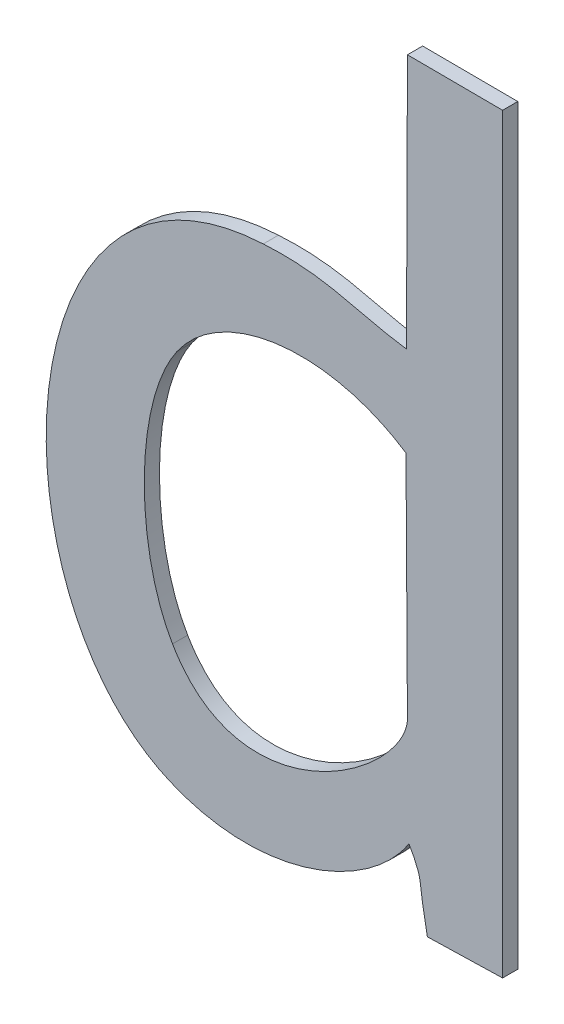
ISO-10303-21;
HEADER;
FILE_DESCRIPTION(('STEP AP214'),'2;1');
FILE_NAME('part.step','',(''),(''),'','','');
FILE_SCHEMA(('AUTOMOTIVE_DESIGN { 1 0 10303 214 1 1 1 1 }'));
ENDSEC;
DATA;
#1=APPLICATION_CONTEXT('core data for automotive mechanical design processes');
#2=APPLICATION_PROTOCOL_DEFINITION('international standard','automotive_design',2000,#1);
#3=PRODUCT_CONTEXT('',#1,'mechanical');
#4=PRODUCT('Part','Part','',(#3));
#5=PRODUCT_RELATED_PRODUCT_CATEGORY('part','',(#4));
#6=PRODUCT_DEFINITION_FORMATION('','',#4);
#7=PRODUCT_DEFINITION_CONTEXT('part definition',#1,'design');
#8=PRODUCT_DEFINITION('design','',#6,#7);
#9=PRODUCT_DEFINITION_SHAPE('','',#8);
#10=(LENGTH_UNIT() NAMED_UNIT(*) SI_UNIT(.MILLI.,.METRE.));
#11=(NAMED_UNIT(*) PLANE_ANGLE_UNIT() SI_UNIT($,.RADIAN.));
#12=(NAMED_UNIT(*) SI_UNIT($,.STERADIAN.) SOLID_ANGLE_UNIT());
#13=UNCERTAINTY_MEASURE_WITH_UNIT(LENGTH_MEASURE(1.E-05),#10,'distance_accuracy_value','');
#14=(GEOMETRIC_REPRESENTATION_CONTEXT(3) GLOBAL_UNCERTAINTY_ASSIGNED_CONTEXT((#13)) GLOBAL_UNIT_ASSIGNED_CONTEXT((#10,
#11,#12)) REPRESENTATION_CONTEXT('',''));
#15=CARTESIAN_POINT('',(0.,0.,0.));
#16=DIRECTION('',(0.,0.,1.));
#17=DIRECTION('',(1.,0.,0.));
#18=AXIS2_PLACEMENT_3D('',#15,#16,#17);
#19=CARTESIAN_POINT('',(-21.9481425563144,-12.193412531205,0.001));
#20=DIRECTION('',(0.874157276122904,0.485642931176173,0.));
#21=DIRECTION('',(-0.485642931176173,0.874157276122904,0.));
#22=AXIS2_PLACEMENT_3D('',#19,#20,#21);
#23=PLANE('',#22);
#24=DIRECTION('',(0.485642931176173,-0.874157276122904,0.));
#25=VECTOR('',#24,1.);
#26=CARTESIAN_POINT('',(-21.9481425563144,-12.193412531205,0.));
#27=LINE('',#26,#25);
#28=CARTESIAN_POINT('',(-1.703489296875,-48.6337883984375,0.));
#29=VERTEX_POINT('',#28);
#30=CARTESIAN_POINT('',(-1.703169375,-48.6343642578125,0.));
#31=VERTEX_POINT('',#30);
#32=EDGE_CURVE('E11',#29,#31,#27,.T.);
#33=ORIENTED_EDGE('',*,*,#32,.T.);
#34=DIRECTION('',(0.,0.,-1.));
#35=VECTOR('',#34,1.);
#36=CARTESIAN_POINT('',(-1.703169375,-48.6343642578125,0.001));
#37=LINE('',#36,#35);
#38=CARTESIAN_POINT('',(-1.703169375,-48.6343642578125,0.001));
#39=VERTEX_POINT('',#38);
#40=EDGE_CURVE('E24',#39,#31,#37,.T.);
#41=ORIENTED_EDGE('',*,*,#40,.F.);
#42=DIRECTION('',(0.485642931176173,-0.874157276122904,0.));
#43=VECTOR('',#42,1.);
#44=CARTESIAN_POINT('',(-21.9481425563144,-12.193412531205,0.001));
#45=LINE('',#44,#43);
#46=CARTESIAN_POINT('',(-1.703489296875,-48.6337883984375,0.001));
#47=VERTEX_POINT('',#46);
#48=EDGE_CURVE('E272',#47,#39,#45,.T.);
#49=ORIENTED_EDGE('',*,*,#48,.F.);
#50=DIRECTION('',(0.,0.,-1.));
#51=VECTOR('',#50,1.);
#52=CARTESIAN_POINT('',(-1.703489296875,-48.6337883984375,0.001));
#53=LINE('',#52,#51);
#54=EDGE_CURVE('E267',#47,#29,#53,.T.);
#55=ORIENTED_EDGE('',*,*,#54,.T.);
#56=EDGE_LOOP('',(#33,#41,#49,#55));
#57=FACE_BOUND('',#56,.T.);
#58=ADVANCED_FACE('F17',(#57),#23,.F.);
#59=CARTESIAN_POINT('',(-1.703169375,-48.6343642578125,0.001));
#60=CARTESIAN_POINT('',(-1.703169375,-48.6343642578125,0.));
#61=CARTESIAN_POINT('',(-1.70252953125,-48.635739921875,0.001));
#62=CARTESIAN_POINT('',(-1.70252953125,-48.635739921875,0.));
#63=CARTESIAN_POINT('',(-1.7029454296875,-48.6351320703125,0.001));
#64=CARTESIAN_POINT('',(-1.7029454296875,-48.6351320703125,0.));
#65=CARTESIAN_POINT('',(-1.70227359375,-48.63849125,0.001));
#66=CARTESIAN_POINT('',(-1.70227359375,-48.63849125,0.));
#67=B_SPLINE_SURFACE_WITH_KNOTS('',3,1,((#59,#60),(#61,#62),(#63,#64),(#65,#66)),.UNSPECIFIED.,
.F.,.F.,.F.,(4,4),(2,2),(0.4,0.5),(0.,1.),.UNSPECIFIED.);
#68=CARTESIAN_POINT('',(-1.703169375,-48.6343642578125,0.));
#69=CARTESIAN_POINT('',(-1.70252953125,-48.635739921875,0.));
#70=CARTESIAN_POINT('',(-1.7029454296875,-48.6351320703125,0.));
#71=CARTESIAN_POINT('',(-1.70227359375,-48.63849125,0.));
#72=B_SPLINE_CURVE_WITH_KNOTS('',3,(#68,#69,#70,#71),.UNSPECIFIED.,.F.,.F.,(4,4),(0.4,0.5),.UNSPECIFIED.);
#73=CARTESIAN_POINT('',(-1.70227359375,-48.63849125,0.));
#74=VERTEX_POINT('',#73);
#75=EDGE_CURVE('E262',#31,#74,#72,.T.);
#76=DIRECTION('',(0.,0.,-1.));
#77=VECTOR('',#76,1.);
#78=CARTESIAN_POINT('',(-1.70227359375,-48.63849125,0.001));
#79=LINE('',#78,#77);
#80=CARTESIAN_POINT('',(-1.70227359375,-48.63849125,0.001));
#81=VERTEX_POINT('',#80);
#82=EDGE_CURVE('E257',#81,#74,#79,.T.);
#83=CARTESIAN_POINT('',(-1.703169375,-48.6343642578125,0.001));
#84=CARTESIAN_POINT('',(-1.70252953125,-48.635739921875,0.001));
#85=CARTESIAN_POINT('',(-1.7029454296875,-48.6351320703125,0.001));
#86=CARTESIAN_POINT('',(-1.70227359375,-48.63849125,0.001));
#87=B_SPLINE_CURVE_WITH_KNOTS('',3,(#83,#84,#85,#86),.UNSPECIFIED.,.F.,.F.,(4,4),(0.4,0.5),.UNSPECIFIED.);
#88=EDGE_CURVE('E253',#39,#81,#87,.T.);
#89=ORIENTED_EDGE('',*,*,#75,.T.);
#90=ORIENTED_EDGE('',*,*,#82,.F.);
#91=ORIENTED_EDGE('',*,*,#88,.F.);
#92=ORIENTED_EDGE('',*,*,#40,.T.);
#93=EDGE_LOOP('',(#89,#90,#91,#92));
#94=FACE_BOUND('',#93,.T.);
#95=ADVANCED_FACE('F276',(#94),#67,.F.);
#96=CARTESIAN_POINT('',(1.253218593127,-48.5622204838874,0.001));
#97=DIRECTION('',(-0.0257978627032479,0.999667179755315,0.));
#98=DIRECTION('',(-0.999667179755315,-0.0257978627032479,0.));
#99=AXIS2_PLACEMENT_3D('',#96,#97,#98);
#100=PLANE('',#99);
#101=DIRECTION('',(0.999667179755314,0.0257978627032479,0.));
#102=VECTOR('',#101,1.);
#103=CARTESIAN_POINT('',(1.253218593127,-48.5622204838874,0.));
#104=LINE('',#103,#102);
#105=CARTESIAN_POINT('',(-1.6973148046875,-48.63836328125,0.));
#106=VERTEX_POINT('',#105);
#107=EDGE_CURVE('E251',#74,#106,#104,.T.);
#108=ORIENTED_EDGE('',*,*,#107,.T.);
#109=DIRECTION('',(0.,0.,-1.));
#110=VECTOR('',#109,1.);
#111=CARTESIAN_POINT('',(-1.6973148046875,-48.63836328125,0.001));
#112=LINE('',#111,#110);
#113=CARTESIAN_POINT('',(-1.6973148046875,-48.63836328125,0.001));
#114=VERTEX_POINT('',#113);
#115=EDGE_CURVE('E248',#114,#106,#112,.T.);
#116=ORIENTED_EDGE('',*,*,#115,.F.);
#117=DIRECTION('',(0.999667179755314,0.0257978627032479,0.));
#118=VECTOR('',#117,1.);
#119=CARTESIAN_POINT('',(1.253218593127,-48.5622204838874,0.001));
#120=LINE('',#119,#118);
#121=EDGE_CURVE('E245',#81,#114,#120,.T.);
#122=ORIENTED_EDGE('',*,*,#121,.F.);
#123=ORIENTED_EDGE('',*,*,#82,.T.);
#124=EDGE_LOOP('',(#108,#116,#122,#123));
#125=FACE_BOUND('',#124,.T.);
#126=ADVANCED_FACE('F283',(#125),#100,.F.);
#127=CARTESIAN_POINT('',(-1.6973148046875,0.,0.001));
#128=DIRECTION('',(-1.,0.,0.));
#129=DIRECTION('',(0.,0.,1.));
#130=AXIS2_PLACEMENT_3D('',#127,#128,#129);
#131=PLANE('',#130);
#132=DIRECTION('',(0.,1.,0.));
#133=VECTOR('',#132,1.);
#134=CARTESIAN_POINT('',(-1.6973148046875,0.,0.));
#135=LINE('',#134,#133);
#136=CARTESIAN_POINT('',(-1.6973148046875,-48.588839375,0.));
#137=VERTEX_POINT('',#136);
#138=EDGE_CURVE('E243',#106,#137,#135,.T.);
#139=ORIENTED_EDGE('',*,*,#138,.T.);
#140=DIRECTION('',(0.,0.,-1.));
#141=VECTOR('',#140,1.);
#142=CARTESIAN_POINT('',(-1.6973148046875,-48.588839375,0.001));
#143=LINE('',#142,#141);
#144=CARTESIAN_POINT('',(-1.6973148046875,-48.588839375,0.001));
#145=VERTEX_POINT('',#144);
#146=EDGE_CURVE('E240',#145,#137,#143,.T.);
#147=ORIENTED_EDGE('',*,*,#146,.F.);
#148=DIRECTION('',(0.,1.,0.));
#149=VECTOR('',#148,1.);
#150=CARTESIAN_POINT('',(-1.6973148046875,0.,0.001));
#151=LINE('',#150,#149);
#152=EDGE_CURVE('E237',#114,#145,#151,.T.);
#153=ORIENTED_EDGE('',*,*,#152,.F.);
#154=ORIENTED_EDGE('',*,*,#115,.T.);
#155=EDGE_LOOP('',(#139,#147,#153,#154));
#156=FACE_BOUND('',#155,.T.);
#157=ADVANCED_FACE('F287',(#156),#131,.F.);
#158=CARTESIAN_POINT('',(-0.247939970097321,-48.5962341445634,0.001));
#159=DIRECTION('',(-0.0051019744118924,-0.999986984843853,0.));
#160=DIRECTION('',(0.999986984843853,-0.0051019744118924,0.));
#161=AXIS2_PLACEMENT_3D('',#158,#159,#160);
#162=PLANE('',#161);
#163=DIRECTION('',(-0.999986984843853,0.0051019744118924,0.));
#164=VECTOR('',#163,1.);
#165=CARTESIAN_POINT('',(-0.247939970097321,-48.5962341445634,0.));
#166=LINE('',#165,#164);
#167=CARTESIAN_POINT('',(-1.7035852734375,-48.5888073828125,0.));
#168=VERTEX_POINT('',#167);
#169=EDGE_CURVE('E235',#137,#168,#166,.T.);
#170=ORIENTED_EDGE('',*,*,#169,.T.);
#171=DIRECTION('',(0.,0.,-1.));
#172=VECTOR('',#171,1.);
#173=CARTESIAN_POINT('',(-1.7035852734375,-48.5888073828125,0.001));
#174=LINE('',#173,#172);
#175=CARTESIAN_POINT('',(-1.7035852734375,-48.5888073828125,0.001));
#176=VERTEX_POINT('',#175);
#177=EDGE_CURVE('E232',#176,#168,#174,.T.);
#178=ORIENTED_EDGE('',*,*,#177,.F.);
#179=DIRECTION('',(-0.999986984843853,0.0051019744118924,0.));
#180=VECTOR('',#179,1.);
#181=CARTESIAN_POINT('',(-0.247939970097321,-48.5962341445634,0.001));
#182=LINE('',#181,#180);
#183=EDGE_CURVE('E229',#145,#176,#182,.T.);
#184=ORIENTED_EDGE('',*,*,#183,.F.);
#185=ORIENTED_EDGE('',*,*,#146,.T.);
#186=EDGE_LOOP('',(#170,#178,#184,#185));
#187=FACE_BOUND('',#186,.T.);
#188=ADVANCED_FACE('F291',(#187),#162,.F.);
#189=CARTESIAN_POINT('',(-1.5188149983625,0.00577496197095341,0.001));
#190=DIRECTION('',(0.999992771406576,-0.0038022538836708,0.));
#191=DIRECTION('',(0.0038022538836708,0.999992771406576,0.));
#192=AXIS2_PLACEMENT_3D('',#189,#190,#191);
#193=PLANE('',#192);
#194=DIRECTION('',(-0.0038022538836708,-0.999992771406576,0.));
#195=VECTOR('',#194,1.);
#196=CARTESIAN_POINT('',(-1.5188149983625,0.00577496197095341,0.));
#197=LINE('',#196,#195);
#198=CARTESIAN_POINT('',(-1.7036492578125,-48.6056352734375,0.));
#199=VERTEX_POINT('',#198);
#200=EDGE_CURVE('E227',#168,#199,#197,.T.);
#201=ORIENTED_EDGE('',*,*,#200,.T.);
#202=DIRECTION('',(0.,0.,-1.));
#203=VECTOR('',#202,1.);
#204=CARTESIAN_POINT('',(-1.7036492578125,-48.6056352734375,0.001));
#205=LINE('',#204,#203);
#206=CARTESIAN_POINT('',(-1.7036492578125,-48.6056352734375,0.001));
#207=VERTEX_POINT('',#206);
#208=EDGE_CURVE('E224',#207,#199,#205,.T.);
#209=ORIENTED_EDGE('',*,*,#208,.F.);
#210=DIRECTION('',(-0.0038022538836708,-0.999992771406576,0.));
#211=VECTOR('',#210,1.);
#212=CARTESIAN_POINT('',(-1.5188149983625,0.00577496197095341,0.001));
#213=LINE('',#212,#211);
#214=EDGE_CURVE('E218',#176,#207,#213,.T.);
#215=ORIENTED_EDGE('',*,*,#214,.F.);
#216=ORIENTED_EDGE('',*,*,#177,.T.);
#217=EDGE_LOOP('',(#201,#209,#215,#216));
#218=FACE_BOUND('',#217,.T.);
#219=ADVANCED_FACE('F294',(#218),#193,.F.);
#220=CARTESIAN_POINT('',(-1.7036492578125,-48.6056352734375,0.001));
#221=CARTESIAN_POINT('',(-1.7036492578125,-48.6056352734375,0.));
#222=CARTESIAN_POINT('',(-1.7069764453125,-48.6051873828125,0.001));
#223=CARTESIAN_POINT('',(-1.7069764453125,-48.6051873828125,0.));
#224=CARTESIAN_POINT('',(-1.7088,-48.6040996484375,0.001));
#225=CARTESIAN_POINT('',(-1.7088,-48.6040996484375,0.));
#226=CARTESIAN_POINT('',(-1.713086953125,-48.6043555859375,0.001));
#227=CARTESIAN_POINT('',(-1.713086953125,-48.6043555859375,0.));
#228=B_SPLINE_SURFACE_WITH_KNOTS('',3,1,((#220,#221),(#222,#223),(#224,#225),(#226,#227)),
.UNSPECIFIED.,.F.,.F.,.F.,(4,4),(2,2),(0.,0.1),(0.,1.),.UNSPECIFIED.);
#229=CARTESIAN_POINT('',(-1.7036492578125,-48.6056352734375,0.));
#230=CARTESIAN_POINT('',(-1.7069764453125,-48.6051873828125,0.));
#231=CARTESIAN_POINT('',(-1.7088,-48.6040996484375,0.));
#232=CARTESIAN_POINT('',(-1.713086953125,-48.6043555859375,0.));
#233=B_SPLINE_CURVE_WITH_KNOTS('',3,(#229,#230,#231,#232),.UNSPECIFIED.,.F.,.F.,(4,4),(0.,0.1),.UNSPECIFIED.);
#234=CARTESIAN_POINT('',(-1.713086953125,-48.6043555859375,0.));
#235=VERTEX_POINT('',#234);
#236=EDGE_CURVE('E213',#199,#235,#233,.T.);
#237=DIRECTION('',(0.,0.,-1.));
#238=VECTOR('',#237,1.);
#239=CARTESIAN_POINT('',(-1.713086953125,-48.6043555859375,0.001));
#240=LINE('',#239,#238);
#241=CARTESIAN_POINT('',(-1.713086953125,-48.6043555859375,0.001));
#242=VERTEX_POINT('',#241);
#243=EDGE_CURVE('E208',#242,#235,#240,.T.);
#244=CARTESIAN_POINT('',(-1.7036492578125,-48.6056352734375,0.001));
#245=CARTESIAN_POINT('',(-1.7069764453125,-48.6051873828125,0.001));
#246=CARTESIAN_POINT('',(-1.7088,-48.6040996484375,0.001));
#247=CARTESIAN_POINT('',(-1.713086953125,-48.6043555859375,0.001));
#248=B_SPLINE_CURVE_WITH_KNOTS('',3,(#244,#245,#246,#247),.UNSPECIFIED.,.F.,.F.,(4,4),(0.,0.1),.UNSPECIFIED.);
#249=EDGE_CURVE('E201',#207,#242,#248,.T.);
#250=ORIENTED_EDGE('',*,*,#236,.T.);
#251=ORIENTED_EDGE('',*,*,#243,.F.);
#252=ORIENTED_EDGE('',*,*,#249,.F.);
#253=ORIENTED_EDGE('',*,*,#208,.T.);
#254=EDGE_LOOP('',(#250,#251,#252,#253));
#255=FACE_BOUND('',#254,.T.);
#256=ADVANCED_FACE('F299',(#255),#228,.F.);
#257=CARTESIAN_POINT('',(-1.713086953125,-48.6043555859375,0.001));
#258=CARTESIAN_POINT('',(-1.713086953125,-48.6043555859375,0.));
#259=CARTESIAN_POINT('',(-1.73029875,-48.6052513671875,0.001));
#260=CARTESIAN_POINT('',(-1.73029875,-48.6052513671875,0.));
#261=CARTESIAN_POINT('',(-1.731514453125,-48.632860625,0.001));
#262=CARTESIAN_POINT('',(-1.731514453125,-48.632860625,0.));
#263=CARTESIAN_POINT('',(-1.719229453125,-48.63810734375,0.001));
#264=CARTESIAN_POINT('',(-1.719229453125,-48.63810734375,0.));
#265=B_SPLINE_SURFACE_WITH_KNOTS('',3,1,((#257,#258),(#259,#260),(#261,#262),(#263,#264)),
.UNSPECIFIED.,.F.,.F.,.F.,(4,4),(2,2),(0.1,0.2),(0.,1.),.UNSPECIFIED.);
#266=CARTESIAN_POINT('',(-1.713086953125,-48.6043555859375,0.));
#267=CARTESIAN_POINT('',(-1.73029875,-48.6052513671875,0.));
#268=CARTESIAN_POINT('',(-1.731514453125,-48.632860625,0.));
#269=CARTESIAN_POINT('',(-1.719229453125,-48.63810734375,0.));
#270=B_SPLINE_CURVE_WITH_KNOTS('',3,(#266,#267,#268,#269),.UNSPECIFIED.,.F.,.F.,(4,4),(0.1,0.2),.UNSPECIFIED.);
#271=CARTESIAN_POINT('',(-1.719229453125,-48.63810734375,0.));
#272=VERTEX_POINT('',#271);
#273=EDGE_CURVE('E196',#235,#272,#270,.T.);
#274=DIRECTION('',(0.,0.,-1.));
#275=VECTOR('',#274,1.);
#276=CARTESIAN_POINT('',(-1.719229453125,-48.63810734375,0.001));
#277=LINE('',#276,#275);
#278=CARTESIAN_POINT('',(-1.719229453125,-48.63810734375,0.001));
#279=VERTEX_POINT('',#278);
#280=EDGE_CURVE('E191',#279,#272,#277,.T.);
#281=CARTESIAN_POINT('',(-1.713086953125,-48.6043555859375,0.001));
#282=CARTESIAN_POINT('',(-1.73029875,-48.6052513671875,0.001));
#283=CARTESIAN_POINT('',(-1.731514453125,-48.632860625,0.001));
#284=CARTESIAN_POINT('',(-1.719229453125,-48.63810734375,0.001));
#285=B_SPLINE_CURVE_WITH_KNOTS('',3,(#281,#282,#283,#284),.UNSPECIFIED.,.F.,.F.,(4,4),(0.1,0.2),.UNSPECIFIED.);
#286=EDGE_CURVE('E184',#242,#279,#285,.T.);
#287=ORIENTED_EDGE('',*,*,#273,.T.);
#288=ORIENTED_EDGE('',*,*,#280,.F.);
#289=ORIENTED_EDGE('',*,*,#286,.F.);
#290=ORIENTED_EDGE('',*,*,#243,.T.);
#291=EDGE_LOOP('',(#287,#288,#289,#290));
#292=FACE_BOUND('',#291,.T.);
#293=ADVANCED_FACE('F306',(#292),#265,.F.);
#294=CARTESIAN_POINT('',(-1.7190694921875,-48.63017328125,0.001));
#295=CARTESIAN_POINT('',(-1.7190694921875,-48.63017328125,0.));
#296=CARTESIAN_POINT('',(-1.721532890625,-48.626014296875,0.001));
#297=CARTESIAN_POINT('',(-1.721532890625,-48.626014296875,0.));
#298=CARTESIAN_POINT('',(-1.721660859375,-48.617504375,0.001));
#299=CARTESIAN_POINT('',(-1.721660859375,-48.617504375,0.));
#300=CARTESIAN_POINT('',(-1.7187815625,-48.613345390625,0.001));
#301=CARTESIAN_POINT('',(-1.7187815625,-48.613345390625,0.));
#302=B_SPLINE_SURFACE_WITH_KNOTS('',3,1,((#294,#295),(#296,#297),(#298,#299),(#300,#301)),
.UNSPECIFIED.,.F.,.F.,.F.,(4,4),(2,2),(0.2,0.4),(0.,1.),.UNSPECIFIED.);
#303=CARTESIAN_POINT('',(-1.7190694921875,-48.63017328125,0.));
#304=CARTESIAN_POINT('',(-1.721532890625,-48.626014296875,0.));
#305=CARTESIAN_POINT('',(-1.721660859375,-48.617504375,0.));
#306=CARTESIAN_POINT('',(-1.7187815625,-48.613345390625,0.));
#307=B_SPLINE_CURVE_WITH_KNOTS('',3,(#303,#304,#305,#306),.UNSPECIFIED.,.F.,.F.,(4,4),(0.2,0.4),.UNSPECIFIED.);
#308=CARTESIAN_POINT('',(-1.7190694921875,-48.63017328125,0.));
#309=VERTEX_POINT('',#308);
#310=CARTESIAN_POINT('',(-1.7187815625,-48.613345390625,0.));
#311=VERTEX_POINT('',#310);
#312=EDGE_CURVE('E179',#309,#311,#307,.T.);
#313=DIRECTION('',(0.,0.,-1.));
#314=VECTOR('',#313,1.);
#315=CARTESIAN_POINT('',(-1.7187815625,-48.613345390625,0.001));
#316=LINE('',#315,#314);
#317=CARTESIAN_POINT('',(-1.7187815625,-48.613345390625,0.001));
#318=VERTEX_POINT('',#317);
#319=EDGE_CURVE('E174',#318,#311,#316,.T.);
#320=CARTESIAN_POINT('',(-1.7190694921875,-48.63017328125,0.001));
#321=CARTESIAN_POINT('',(-1.721532890625,-48.626014296875,0.001));
#322=CARTESIAN_POINT('',(-1.721660859375,-48.617504375,0.001));
#323=CARTESIAN_POINT('',(-1.7187815625,-48.613345390625,0.001));
#324=B_SPLINE_CURVE_WITH_KNOTS('',3,(#320,#321,#322,#323),.UNSPECIFIED.,.F.,.F.,(4,4),(0.2,0.4),.UNSPECIFIED.);
#325=CARTESIAN_POINT('',(-1.7190694921875,-48.63017328125,0.001));
#326=VERTEX_POINT('',#325);
#327=EDGE_CURVE('E170',#326,#318,#324,.T.);
#328=DIRECTION('',(0.,0.,-1.));
#329=VECTOR('',#328,1.);
#330=CARTESIAN_POINT('',(-1.7190694921875,-48.63017328125,0.001));
#331=LINE('',#330,#329);
#332=EDGE_CURVE('E130',#326,#309,#331,.T.);
#333=ORIENTED_EDGE('',*,*,#312,.T.);
#334=ORIENTED_EDGE('',*,*,#319,.F.);
#335=ORIENTED_EDGE('',*,*,#327,.F.);
#336=ORIENTED_EDGE('',*,*,#332,.T.);
#337=EDGE_LOOP('',(#333,#334,#335,#336));
#338=FACE_BOUND('',#337,.T.);
#339=ADVANCED_FACE('F351',(#338),#302,.F.);
#340=CARTESIAN_POINT('',(-1.7187815625,-48.613345390625,0.001));
#341=CARTESIAN_POINT('',(-1.7187815625,-48.613345390625,0.));
#342=CARTESIAN_POINT('',(-1.715774296875,-48.6090264453125,0.001));
#343=CARTESIAN_POINT('',(-1.715774296875,-48.6090264453125,0.));
#344=CARTESIAN_POINT('',(-1.7087680078125,-48.608226640625,0.001));
#345=CARTESIAN_POINT('',(-1.7087680078125,-48.608226640625,0.));
#346=CARTESIAN_POINT('',(-1.70368125,-48.6115858203125,0.001));
#347=CARTESIAN_POINT('',(-1.70368125,-48.6115858203125,0.));
#348=B_SPLINE_SURFACE_WITH_KNOTS('',3,1,((#340,#341),(#342,#343),(#344,#345),(#346,#347)),
.UNSPECIFIED.,.F.,.F.,.F.,(4,4),(2,2),(0.4,0.6),(0.,1.),.UNSPECIFIED.);
#349=CARTESIAN_POINT('',(-1.7187815625,-48.613345390625,0.));
#350=CARTESIAN_POINT('',(-1.715774296875,-48.6090264453125,0.));
#351=CARTESIAN_POINT('',(-1.7087680078125,-48.608226640625,0.));
#352=CARTESIAN_POINT('',(-1.70368125,-48.6115858203125,0.));
#353=B_SPLINE_CURVE_WITH_KNOTS('',3,(#349,#350,#351,#352),.UNSPECIFIED.,.F.,.F.,(4,4),(0.4,0.6),.UNSPECIFIED.);
#354=CARTESIAN_POINT('',(-1.70368125,-48.6115858203125,0.));
#355=VERTEX_POINT('',#354);
#356=EDGE_CURVE('E161',#311,#355,#353,.T.);
#357=DIRECTION('',(0.,0.,-1.));
#358=VECTOR('',#357,1.);
#359=CARTESIAN_POINT('',(-1.70368125,-48.6115858203125,0.001));
#360=LINE('',#359,#358);
#361=CARTESIAN_POINT('',(-1.70368125,-48.6115858203125,0.001));
#362=VERTEX_POINT('',#361);
#363=EDGE_CURVE('E156',#362,#355,#360,.T.);
#364=CARTESIAN_POINT('',(-1.7187815625,-48.613345390625,0.001));
#365=CARTESIAN_POINT('',(-1.715774296875,-48.6090264453125,0.001));
#366=CARTESIAN_POINT('',(-1.7087680078125,-48.608226640625,0.001));
#367=CARTESIAN_POINT('',(-1.70368125,-48.6115858203125,0.001));
#368=B_SPLINE_CURVE_WITH_KNOTS('',3,(#364,#365,#366,#367),.UNSPECIFIED.,.F.,.F.,(4,4),(0.4,0.6),.UNSPECIFIED.);
#369=EDGE_CURVE('E125',#318,#362,#368,.T.);
#370=ORIENTED_EDGE('',*,*,#356,.T.);
#371=ORIENTED_EDGE('',*,*,#363,.F.);
#372=ORIENTED_EDGE('',*,*,#369,.F.);
#373=ORIENTED_EDGE('',*,*,#319,.T.);
#374=EDGE_LOOP('',(#370,#371,#372,#373));
#375=FACE_BOUND('',#374,.T.);
#376=ADVANCED_FACE('F361',(#375),#348,.F.);
#377=CARTESIAN_POINT('',(-2.0099769510407,-0.0126679219603688,0.001));
#378=DIRECTION('',(0.999980139706132,0.006302395838498,0.));
#379=DIRECTION('',(-0.006302395838498,0.999980139706132,0.));
#380=AXIS2_PLACEMENT_3D('',#377,#378,#379);
#381=PLANE('',#380);
#382=DIRECTION('',(0.006302395838498,-0.999980139706132,0.));
#383=VECTOR('',#382,1.);
#384=CARTESIAN_POINT('',(-2.0099769510407,-0.0126679219603688,0.));
#385=LINE('',#384,#383);
#386=CARTESIAN_POINT('',(-1.7035852734375,-48.6268141015625,0.));
#387=VERTEX_POINT('',#386);
#388=EDGE_CURVE('E113',#355,#387,#385,.T.);
#389=ORIENTED_EDGE('',*,*,#388,.T.);
#390=DIRECTION('',(0.,0.,-1.));
#391=VECTOR('',#390,1.);
#392=CARTESIAN_POINT('',(-1.7035852734375,-48.6268141015625,0.001));
#393=LINE('',#392,#391);
#394=CARTESIAN_POINT('',(-1.7035852734375,-48.6268141015625,0.001));
#395=VERTEX_POINT('',#394);
#396=EDGE_CURVE('E108',#395,#387,#393,.T.);
#397=ORIENTED_EDGE('',*,*,#396,.F.);
#398=DIRECTION('',(0.006302395838498,-0.999980139706132,0.));
#399=VECTOR('',#398,1.);
#400=CARTESIAN_POINT('',(-2.0099769510407,-0.0126679219603688,0.001));
#401=LINE('',#400,#399);
#402=EDGE_CURVE('E111',#362,#395,#401,.T.);
#403=ORIENTED_EDGE('',*,*,#402,.F.);
#404=ORIENTED_EDGE('',*,*,#363,.T.);
#405=EDGE_LOOP('',(#389,#397,#403,#404));
#406=FACE_BOUND('',#405,.T.);
#407=ADVANCED_FACE('F110',(#406),#381,.F.);
#408=CARTESIAN_POINT('',(-1.7035852734375,-48.6268141015625,0.001));
#409=CARTESIAN_POINT('',(-1.7035852734375,-48.6268141015625,0.));
#410=CARTESIAN_POINT('',(-1.7039371875,-48.6303332421875,0.001));
#411=CARTESIAN_POINT('',(-1.7039371875,-48.6303332421875,0.));
#412=CARTESIAN_POINT('',(-1.7144626171875,-48.638043359375,0.001));
#413=CARTESIAN_POINT('',(-1.7144626171875,-48.638043359375,0.));
#414=CARTESIAN_POINT('',(-1.7190694921875,-48.63017328125,0.001));
#415=CARTESIAN_POINT('',(-1.7190694921875,-48.63017328125,0.));
#416=B_SPLINE_SURFACE_WITH_KNOTS('',3,1,((#408,#409),(#410,#411),(#412,#413),(#414,#415)),
.UNSPECIFIED.,.F.,.F.,.F.,(4,4),(2,2),(0.,0.2),(0.,1.),.UNSPECIFIED.);
#417=CARTESIAN_POINT('',(-1.7035852734375,-48.6268141015625,0.));
#418=CARTESIAN_POINT('',(-1.7039371875,-48.6303332421875,0.));
#419=CARTESIAN_POINT('',(-1.7144626171875,-48.638043359375,0.));
#420=CARTESIAN_POINT('',(-1.7190694921875,-48.63017328125,0.));
#421=B_SPLINE_CURVE_WITH_KNOTS('',3,(#417,#418,#419,#420),.UNSPECIFIED.,.F.,.F.,(4,4),(0.,0.2),.UNSPECIFIED.);
#422=EDGE_CURVE('E127',#387,#309,#421,.T.);
#423=CARTESIAN_POINT('',(-1.7035852734375,-48.6268141015625,0.001));
#424=CARTESIAN_POINT('',(-1.7039371875,-48.6303332421875,0.001));
#425=CARTESIAN_POINT('',(-1.7144626171875,-48.638043359375,0.001));
#426=CARTESIAN_POINT('',(-1.7190694921875,-48.63017328125,0.001));
#427=B_SPLINE_CURVE_WITH_KNOTS('',3,(#423,#424,#425,#426),.UNSPECIFIED.,.F.,.F.,(4,4),(0.,0.2),.UNSPECIFIED.);
#428=EDGE_CURVE('E123',#395,#326,#427,.T.);
#429=ORIENTED_EDGE('',*,*,#422,.T.);
#430=ORIENTED_EDGE('',*,*,#332,.F.);
#431=ORIENTED_EDGE('',*,*,#428,.F.);
#432=ORIENTED_EDGE('',*,*,#396,.T.);
#433=EDGE_LOOP('',(#429,#430,#431,#432));
#434=FACE_BOUND('',#433,.T.);
#435=ADVANCED_FACE('F129',(#434),#416,.F.);
#436=CARTESIAN_POINT('',(-1.719229453125,-48.63810734375,0.001));
#437=CARTESIAN_POINT('',(-1.719229453125,-48.63810734375,0.));
#438=CARTESIAN_POINT('',(-1.7128630078125,-48.6408266796875,0.001));
#439=CARTESIAN_POINT('',(-1.7128630078125,-48.6408266796875,0.));
#440=CARTESIAN_POINT('',(-1.705920703125,-48.6376274609375,0.001));
#441=CARTESIAN_POINT('',(-1.705920703125,-48.6376274609375,0.));
#442=CARTESIAN_POINT('',(-1.703489296875,-48.6337883984375,0.001));
#443=CARTESIAN_POINT('',(-1.703489296875,-48.6337883984375,0.));
#444=B_SPLINE_SURFACE_WITH_KNOTS('',3,1,((#436,#437),(#438,#439),(#440,#441),(#442,#443)),
.UNSPECIFIED.,.F.,.F.,.F.,(4,4),(2,2),(0.2,0.3),(0.,1.),.UNSPECIFIED.);
#445=CARTESIAN_POINT('',(-1.719229453125,-48.63810734375,0.));
#446=CARTESIAN_POINT('',(-1.7128630078125,-48.6408266796875,0.));
#447=CARTESIAN_POINT('',(-1.705920703125,-48.6376274609375,0.));
#448=CARTESIAN_POINT('',(-1.703489296875,-48.6337883984375,0.));
#449=B_SPLINE_CURVE_WITH_KNOTS('',3,(#445,#446,#447,#448),.UNSPECIFIED.,.F.,.F.,(4,4),(0.2,0.3),.UNSPECIFIED.);
#450=EDGE_CURVE('E132',#272,#29,#449,.T.);
#451=CARTESIAN_POINT('',(-1.719229453125,-48.63810734375,0.001));
#452=CARTESIAN_POINT('',(-1.7128630078125,-48.6408266796875,0.001));
#453=CARTESIAN_POINT('',(-1.705920703125,-48.6376274609375,0.001));
#454=CARTESIAN_POINT('',(-1.703489296875,-48.6337883984375,0.001));
#455=B_SPLINE_CURVE_WITH_KNOTS('',3,(#451,#452,#453,#454),.UNSPECIFIED.,.F.,.F.,(4,4),(0.2,0.3),.UNSPECIFIED.);
#456=EDGE_CURVE('E136',#279,#47,#455,.T.);
#457=ORIENTED_EDGE('',*,*,#450,.T.);
#458=ORIENTED_EDGE('',*,*,#54,.F.);
#459=ORIENTED_EDGE('',*,*,#456,.F.);
#460=ORIENTED_EDGE('',*,*,#280,.T.);
#461=EDGE_LOOP('',(#457,#458,#459,#460));
#462=FACE_BOUND('',#461,.T.);
#463=ADVANCED_FACE('F309',(#462),#444,.F.);
#464=CARTESIAN_POINT('',(0.,0.,0.001));
#465=DIRECTION('',(0.,0.,1.));
#466=DIRECTION('',(1.,0.,0.));
#467=AXIS2_PLACEMENT_3D('',#464,#465,#466);
#468=PLANE('',#467);
#469=ORIENTED_EDGE('',*,*,#327,.T.);
#470=ORIENTED_EDGE('',*,*,#369,.T.);
#471=ORIENTED_EDGE('',*,*,#402,.T.);
#472=ORIENTED_EDGE('',*,*,#428,.T.);
#473=EDGE_LOOP('',(#469,#470,#471,#472));
#474=FACE_BOUND('',#473,.T.);
#475=ORIENTED_EDGE('',*,*,#48,.T.);
#476=ORIENTED_EDGE('',*,*,#88,.T.);
#477=ORIENTED_EDGE('',*,*,#121,.T.);
#478=ORIENTED_EDGE('',*,*,#152,.T.);
#479=ORIENTED_EDGE('',*,*,#183,.T.);
#480=ORIENTED_EDGE('',*,*,#214,.T.);
#481=ORIENTED_EDGE('',*,*,#249,.T.);
#482=ORIENTED_EDGE('',*,*,#286,.T.);
#483=ORIENTED_EDGE('',*,*,#456,.T.);
#484=EDGE_LOOP('',(#475,#476,#477,#478,#479,#480,#481,#482,#483));
#485=FACE_BOUND('',#484,.T.);
#486=ADVANCED_FACE('F121',(#474,#485),#468,.T.);
#487=CARTESIAN_POINT('',(0.,0.,0.));
#488=DIRECTION('',(0.,0.,1.));
#489=DIRECTION('',(1.,0.,0.));
#490=AXIS2_PLACEMENT_3D('',#487,#488,#489);
#491=PLANE('',#490);
#492=ORIENTED_EDGE('',*,*,#312,.F.);
#493=ORIENTED_EDGE('',*,*,#422,.F.);
#494=ORIENTED_EDGE('',*,*,#388,.F.);
#495=ORIENTED_EDGE('',*,*,#356,.F.);
#496=EDGE_LOOP('',(#492,#493,#494,#495));
#497=FACE_BOUND('',#496,.T.);
#498=ORIENTED_EDGE('',*,*,#32,.F.);
#499=ORIENTED_EDGE('',*,*,#450,.F.);
#500=ORIENTED_EDGE('',*,*,#273,.F.);
#501=ORIENTED_EDGE('',*,*,#236,.F.);
#502=ORIENTED_EDGE('',*,*,#200,.F.);
#503=ORIENTED_EDGE('',*,*,#169,.F.);
#504=ORIENTED_EDGE('',*,*,#138,.F.);
#505=ORIENTED_EDGE('',*,*,#107,.F.);
#506=ORIENTED_EDGE('',*,*,#75,.F.);
#507=EDGE_LOOP('',(#498,#499,#500,#501,#502,#503,#504,#505,#506));
#508=FACE_BOUND('',#507,.T.);
#509=ADVANCED_FACE('F279',(#497,#508),#491,.F.);
#510=CLOSED_SHELL('',(#58,#95,#126,#157,#188,#219,#256,#293,#339,#376,#407,#435,#463,#486,#509));
#511=MANIFOLD_SOLID_BREP('B1',#510);
#512=ADVANCED_BREP_SHAPE_REPRESENTATION('',(#18,#511),#14);
#513=SHAPE_DEFINITION_REPRESENTATION(#9,#512);
ENDSEC;
END-ISO-10303-21;
